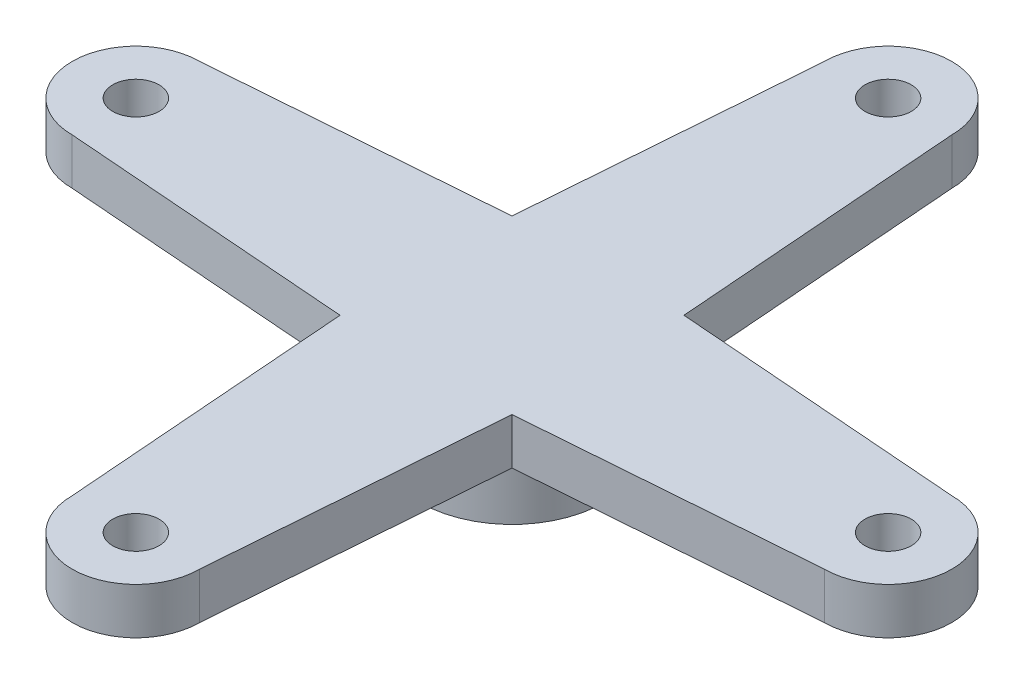
ISO-10303-21;
HEADER;
FILE_DESCRIPTION(('STEP AP214'),'2;1');
FILE_NAME('part.step','',(''),(''),'','','');
FILE_SCHEMA(('AUTOMOTIVE_DESIGN { 1 0 10303 214 1 1 1 1 }'));
ENDSEC;
DATA;
#1=APPLICATION_CONTEXT('core data for automotive mechanical design processes');
#2=APPLICATION_PROTOCOL_DEFINITION('international standard','automotive_design',2000,#1);
#3=PRODUCT_CONTEXT('',#1,'mechanical');
#4=PRODUCT('Part','Part','',(#3));
#5=PRODUCT_RELATED_PRODUCT_CATEGORY('part','',(#4));
#6=PRODUCT_DEFINITION_FORMATION('','',#4);
#7=PRODUCT_DEFINITION_CONTEXT('part definition',#1,'design');
#8=PRODUCT_DEFINITION('design','',#6,#7);
#9=PRODUCT_DEFINITION_SHAPE('','',#8);
#10=(LENGTH_UNIT() NAMED_UNIT(*) SI_UNIT(.MILLI.,.METRE.));
#11=(NAMED_UNIT(*) PLANE_ANGLE_UNIT() SI_UNIT($,.RADIAN.));
#12=(NAMED_UNIT(*) SI_UNIT($,.STERADIAN.) SOLID_ANGLE_UNIT());
#13=UNCERTAINTY_MEASURE_WITH_UNIT(LENGTH_MEASURE(1.E-05),#10,'distance_accuracy_value','');
#14=(GEOMETRIC_REPRESENTATION_CONTEXT(3) GLOBAL_UNCERTAINTY_ASSIGNED_CONTEXT((#13)) GLOBAL_UNIT_ASSIGNED_CONTEXT((#10,
#11,#12)) REPRESENTATION_CONTEXT('',''));
#15=CARTESIAN_POINT('',(0.,0.,0.));
#16=DIRECTION('',(0.,0.,1.));
#17=DIRECTION('',(1.,0.,0.));
#18=AXIS2_PLACEMENT_3D('',#15,#16,#17);
#19=CARTESIAN_POINT('',(3.97647058823529,5.,-0.305882352941177));
#20=DIRECTION('',(-0.997054485501581,0.,0.0766964988847373));
#21=DIRECTION('',(0.0766964988847373,0.,0.997054485501582));
#22=AXIS2_PLACEMENT_3D('',#19,#20,#21);
#23=PLANE('',#22);
#24=DIRECTION('',(-0.0766964988847373,0.,-0.997054485501582));
#25=VECTOR('',#24,1.);
#26=CARTESIAN_POINT('',(3.97647058823529,3.,-0.305882352941177));
#27=LINE('',#26,#25);
#28=CARTESIAN_POINT('',(3.71428571428571,3.,-3.71428571428571));
#29=VERTEX_POINT('',#28);
#30=CARTESIAN_POINT('',(2.7500000000001,3.,-16.2499999999996));
#31=VERTEX_POINT('',#30);
#32=EDGE_CURVE('E189',#29,#31,#27,.T.);
#33=ORIENTED_EDGE('',*,*,#32,.T.);
#34=DIRECTION('',(0.,-1.,0.));
#35=VECTOR('',#34,1.);
#36=CARTESIAN_POINT('',(2.7500000000001,5.,-16.2499999999996));
#37=LINE('',#36,#35);
#38=CARTESIAN_POINT('',(2.7500000000001,5.,-16.2499999999996));
#39=VERTEX_POINT('',#38);
#40=EDGE_CURVE('E12',#39,#31,#37,.T.);
#41=ORIENTED_EDGE('',*,*,#40,.F.);
#42=DIRECTION('',(-0.0766964988847373,0.,-0.997054485501582));
#43=VECTOR('',#42,1.);
#44=CARTESIAN_POINT('',(3.97647058823529,5.,-0.305882352941177));
#45=LINE('',#44,#43);
#46=CARTESIAN_POINT('',(3.71428571428571,5.,-3.71428571428571));
#47=VERTEX_POINT('',#46);
#48=EDGE_CURVE('E247',#47,#39,#45,.T.);
#49=ORIENTED_EDGE('',*,*,#48,.F.);
#50=DIRECTION('',(0.,-1.,0.));
#51=VECTOR('',#50,1.);
#52=CARTESIAN_POINT('',(3.71428571428571,5.,-3.71428571428571));
#53=LINE('',#52,#51);
#54=EDGE_CURVE('E64',#47,#29,#53,.T.);
#55=ORIENTED_EDGE('',*,*,#54,.T.);
#56=EDGE_LOOP('',(#33,#41,#49,#55));
#57=FACE_BOUND('',#56,.T.);
#58=ADVANCED_FACE('F47',(#57),#23,.F.);
#59=CARTESIAN_POINT('',(1.71077077006591E-13,5.,-16.25));
#60=DIRECTION('',(0.,-1.,0.));
#61=DIRECTION('',(0.,0.,-1.));
#62=AXIS2_PLACEMENT_3D('',#59,#60,#61);
#63=CYLINDRICAL_SURFACE('',#62,2.75);
#64=CARTESIAN_POINT('',(1.71077077006591E-13,3.,-16.25));
#65=DIRECTION('',(0.,1.,0.));
#66=DIRECTION('',(0.,0.,1.));
#67=AXIS2_PLACEMENT_3D('',#64,#65,#66);
#68=CIRCLE('',#67,2.75);
#69=CARTESIAN_POINT('',(-2.7499999999999,3.,-16.2500000000004));
#70=VERTEX_POINT('',#69);
#71=EDGE_CURVE('E192',#31,#70,#68,.T.);
#72=ORIENTED_EDGE('',*,*,#71,.T.);
#73=DIRECTION('',(0.,-1.,0.));
#74=VECTOR('',#73,1.);
#75=CARTESIAN_POINT('',(-2.7499999999999,5.,-16.2500000000004));
#76=LINE('',#75,#74);
#77=CARTESIAN_POINT('',(-2.7499999999999,5.,-16.2500000000004));
#78=VERTEX_POINT('',#77);
#79=EDGE_CURVE('E56',#78,#70,#76,.T.);
#80=ORIENTED_EDGE('',*,*,#79,.F.);
#81=CARTESIAN_POINT('',(1.71077077006591E-13,5.,-16.25));
#82=DIRECTION('',(0.,1.,0.));
#83=DIRECTION('',(0.,0.,1.));
#84=AXIS2_PLACEMENT_3D('',#81,#82,#83);
#85=CIRCLE('',#84,2.75);
#86=EDGE_CURVE('E115',#39,#78,#85,.T.);
#87=ORIENTED_EDGE('',*,*,#86,.F.);
#88=ORIENTED_EDGE('',*,*,#40,.T.);
#89=EDGE_LOOP('',(#72,#80,#87,#88));
#90=FACE_BOUND('',#89,.T.);
#91=ADVANCED_FACE('F280',(#90),#63,.T.);
#92=CARTESIAN_POINT('',(-3.97647058823529,5.,-0.305882352941176));
#93=DIRECTION('',(-0.997054485501582,0.,-0.076696498884737));
#94=DIRECTION('',(-0.076696498884737,0.,0.997054485501582));
#95=AXIS2_PLACEMENT_3D('',#92,#93,#94);
#96=PLANE('',#95);
#97=DIRECTION('',(0.076696498884737,0.,-0.997054485501582));
#98=VECTOR('',#97,1.);
#99=CARTESIAN_POINT('',(-3.97647058823529,3.,-0.305882352941176));
#100=LINE('',#99,#98);
#101=CARTESIAN_POINT('',(-3.71428571428572,3.,-3.71428571428571));
#102=VERTEX_POINT('',#101);
#103=EDGE_CURVE('E196',#102,#70,#100,.T.);
#104=ORIENTED_EDGE('',*,*,#103,.F.);
#105=DIRECTION('',(0.,-1.,0.));
#106=VECTOR('',#105,1.);
#107=CARTESIAN_POINT('',(-3.71428571428572,5.,-3.71428571428571));
#108=LINE('',#107,#106);
#109=CARTESIAN_POINT('',(-3.71428571428572,5.,-3.71428571428571));
#110=VERTEX_POINT('',#109);
#111=EDGE_CURVE('E271',#110,#102,#108,.T.);
#112=ORIENTED_EDGE('',*,*,#111,.F.);
#113=DIRECTION('',(0.076696498884737,0.,-0.997054485501582));
#114=VECTOR('',#113,1.);
#115=CARTESIAN_POINT('',(-3.97647058823529,5.,-0.305882352941176));
#116=LINE('',#115,#114);
#117=EDGE_CURVE('E279',#110,#78,#116,.T.);
#118=ORIENTED_EDGE('',*,*,#117,.T.);
#119=ORIENTED_EDGE('',*,*,#79,.T.);
#120=EDGE_LOOP('',(#104,#112,#118,#119));
#121=FACE_BOUND('',#120,.T.);
#122=ADVANCED_FACE('F277',(#121),#96,.T.);
#123=CARTESIAN_POINT('',(-0.305882352941177,5.,-3.97647058823529));
#124=DIRECTION('',(0.0766964988847372,0.,0.997054485501581));
#125=DIRECTION('',(0.997054485501582,0.,-0.0766964988847372));
#126=AXIS2_PLACEMENT_3D('',#123,#124,#125);
#127=PLANE('',#126);
#128=DIRECTION('',(-0.997054485501582,0.,0.0766964988847372));
#129=VECTOR('',#128,1.);
#130=CARTESIAN_POINT('',(-0.305882352941177,3.,-3.97647058823529));
#131=LINE('',#130,#129);
#132=CARTESIAN_POINT('',(-16.2500000000004,3.,-2.75000000000004));
#133=VERTEX_POINT('',#132);
#134=EDGE_CURVE('E200',#102,#133,#131,.T.);
#135=ORIENTED_EDGE('',*,*,#134,.T.);
#136=DIRECTION('',(0.,-1.,0.));
#137=VECTOR('',#136,1.);
#138=CARTESIAN_POINT('',(-16.2500000000004,5.,-2.75000000000004));
#139=LINE('',#138,#137);
#140=CARTESIAN_POINT('',(-16.2500000000004,5.,-2.75000000000004));
#141=VERTEX_POINT('',#140);
#142=EDGE_CURVE('E267',#141,#133,#139,.T.);
#143=ORIENTED_EDGE('',*,*,#142,.F.);
#144=DIRECTION('',(-0.997054485501582,0.,0.0766964988847372));
#145=VECTOR('',#144,1.);
#146=CARTESIAN_POINT('',(-0.305882352941177,5.,-3.97647058823529));
#147=LINE('',#146,#145);
#148=EDGE_CURVE('E300',#110,#141,#147,.T.);
#149=ORIENTED_EDGE('',*,*,#148,.F.);
#150=ORIENTED_EDGE('',*,*,#111,.T.);
#151=EDGE_LOOP('',(#135,#143,#149,#150));
#152=FACE_BOUND('',#151,.T.);
#153=ADVANCED_FACE('F289',(#152),#127,.F.);
#154=CARTESIAN_POINT('',(-16.25,5.,-1.13473143512402E-13));
#155=DIRECTION('',(0.,-1.,0.));
#156=DIRECTION('',(0.,0.,-1.));
#157=AXIS2_PLACEMENT_3D('',#154,#155,#156);
#158=CYLINDRICAL_SURFACE('',#157,2.75);
#159=CARTESIAN_POINT('',(-16.25,3.,-1.13473143512402E-13));
#160=DIRECTION('',(0.,1.,0.));
#161=DIRECTION('',(0.,0.,1.));
#162=AXIS2_PLACEMENT_3D('',#159,#160,#161);
#163=CIRCLE('',#162,2.75);
#164=CARTESIAN_POINT('',(-16.25,3.,2.74999999999994));
#165=VERTEX_POINT('',#164);
#166=EDGE_CURVE('E203',#133,#165,#163,.T.);
#167=ORIENTED_EDGE('',*,*,#166,.T.);
#168=DIRECTION('',(0.,-1.,0.));
#169=VECTOR('',#168,1.);
#170=CARTESIAN_POINT('',(-16.25,5.,2.74999999999994));
#171=LINE('',#170,#169);
#172=CARTESIAN_POINT('',(-16.25,5.,2.74999999999994));
#173=VERTEX_POINT('',#172);
#174=EDGE_CURVE('E264',#173,#165,#171,.T.);
#175=ORIENTED_EDGE('',*,*,#174,.F.);
#176=CARTESIAN_POINT('',(-16.25,5.,-1.13473143512402E-13));
#177=DIRECTION('',(0.,1.,0.));
#178=DIRECTION('',(0.,0.,1.));
#179=AXIS2_PLACEMENT_3D('',#176,#177,#178);
#180=CIRCLE('',#179,2.75);
#181=EDGE_CURVE('E295',#141,#173,#180,.T.);
#182=ORIENTED_EDGE('',*,*,#181,.F.);
#183=ORIENTED_EDGE('',*,*,#142,.T.);
#184=EDGE_LOOP('',(#167,#175,#182,#183));
#185=FACE_BOUND('',#184,.T.);
#186=ADVANCED_FACE('F293',(#185),#158,.T.);
#187=CARTESIAN_POINT('',(-0.305882352941177,5.,3.97647058823529));
#188=DIRECTION('',(-0.0766964988847371,0.,0.997054485501582));
#189=DIRECTION('',(0.997054485501582,0.,0.0766964988847371));
#190=AXIS2_PLACEMENT_3D('',#187,#188,#189);
#191=PLANE('',#190);
#192=DIRECTION('',(-0.997054485501582,0.,-0.0766964988847371));
#193=VECTOR('',#192,1.);
#194=CARTESIAN_POINT('',(-0.305882352941177,3.,3.97647058823529));
#195=LINE('',#194,#193);
#196=CARTESIAN_POINT('',(-3.71428571428573,3.,3.71428571428571));
#197=VERTEX_POINT('',#196);
#198=EDGE_CURVE('E207',#197,#165,#195,.T.);
#199=ORIENTED_EDGE('',*,*,#198,.F.);
#200=DIRECTION('',(0.,-1.,0.));
#201=VECTOR('',#200,1.);
#202=CARTESIAN_POINT('',(-3.71428571428573,5.,3.71428571428571));
#203=LINE('',#202,#201);
#204=CARTESIAN_POINT('',(-3.71428571428573,5.,3.71428571428571));
#205=VERTEX_POINT('',#204);
#206=EDGE_CURVE('E261',#205,#197,#203,.T.);
#207=ORIENTED_EDGE('',*,*,#206,.F.);
#208=DIRECTION('',(-0.997054485501582,0.,-0.0766964988847371));
#209=VECTOR('',#208,1.);
#210=CARTESIAN_POINT('',(-0.305882352941177,5.,3.97647058823529));
#211=LINE('',#210,#209);
#212=EDGE_CURVE('E299',#205,#173,#211,.T.);
#213=ORIENTED_EDGE('',*,*,#212,.T.);
#214=ORIENTED_EDGE('',*,*,#174,.T.);
#215=EDGE_LOOP('',(#199,#207,#213,#214));
#216=FACE_BOUND('',#215,.T.);
#217=ADVANCED_FACE('F352',(#216),#191,.T.);
#218=CARTESIAN_POINT('',(-3.97647058823531,5.,0.305882352941183));
#219=DIRECTION('',(0.997054485501581,0.,-0.0766964988847385));
#220=DIRECTION('',(-0.0766964988847385,0.,-0.997054485501581));
#221=AXIS2_PLACEMENT_3D('',#218,#219,#220);
#222=PLANE('',#221);
#223=DIRECTION('',(0.0766964988847385,0.,0.997054485501581));
#224=VECTOR('',#223,1.);
#225=CARTESIAN_POINT('',(-3.97647058823531,3.,0.305882352941183));
#226=LINE('',#225,#224);
#227=CARTESIAN_POINT('',(-2.75000000000001,3.,16.2500000000004));
#228=VERTEX_POINT('',#227);
#229=EDGE_CURVE('E211',#197,#228,#226,.T.);
#230=ORIENTED_EDGE('',*,*,#229,.T.);
#231=DIRECTION('',(0.,-1.,0.));
#232=VECTOR('',#231,1.);
#233=CARTESIAN_POINT('',(-2.75000000000001,5.,16.2500000000004));
#234=LINE('',#233,#232);
#235=CARTESIAN_POINT('',(-2.75000000000001,5.,16.2500000000004));
#236=VERTEX_POINT('',#235);
#237=EDGE_CURVE('E257',#236,#228,#234,.T.);
#238=ORIENTED_EDGE('',*,*,#237,.F.);
#239=DIRECTION('',(0.0766964988847385,0.,0.997054485501581));
#240=VECTOR('',#239,1.);
#241=CARTESIAN_POINT('',(-3.97647058823531,5.,0.305882352941183));
#242=LINE('',#241,#240);
#243=EDGE_CURVE('E304',#205,#236,#242,.T.);
#244=ORIENTED_EDGE('',*,*,#243,.F.);
#245=ORIENTED_EDGE('',*,*,#206,.T.);
#246=EDGE_LOOP('',(#230,#238,#244,#245));
#247=FACE_BOUND('',#246,.T.);
#248=ADVANCED_FACE('F355',(#247),#222,.F.);
#249=CARTESIAN_POINT('',(0.,5.,16.25));
#250=DIRECTION('',(0.,-1.,0.));
#251=DIRECTION('',(0.,0.,-1.));
#252=AXIS2_PLACEMENT_3D('',#249,#250,#251);
#253=CYLINDRICAL_SURFACE('',#252,2.75);
#254=CARTESIAN_POINT('',(0.,3.,16.25));
#255=DIRECTION('',(0.,1.,0.));
#256=DIRECTION('',(0.,0.,1.));
#257=AXIS2_PLACEMENT_3D('',#254,#255,#256);
#258=CIRCLE('',#257,2.75);
#259=CARTESIAN_POINT('',(2.74999999999946,3.,16.2500000000132));
#260=VERTEX_POINT('',#259);
#261=EDGE_CURVE('E214',#228,#260,#258,.T.);
#262=ORIENTED_EDGE('',*,*,#261,.T.);
#263=DIRECTION('',(0.,-1.,0.));
#264=VECTOR('',#263,1.);
#265=CARTESIAN_POINT('',(2.74999999999946,5.,16.2500000000132));
#266=LINE('',#265,#264);
#267=CARTESIAN_POINT('',(2.74999999999946,5.,16.2500000000132));
#268=VERTEX_POINT('',#267);
#269=EDGE_CURVE('E254',#268,#260,#266,.T.);
#270=ORIENTED_EDGE('',*,*,#269,.F.);
#271=CARTESIAN_POINT('',(0.,5.,16.25));
#272=DIRECTION('',(0.,1.,0.));
#273=DIRECTION('',(0.,0.,1.));
#274=AXIS2_PLACEMENT_3D('',#271,#272,#273);
#275=CIRCLE('',#274,2.75);
#276=EDGE_CURVE('E311',#236,#268,#275,.T.);
#277=ORIENTED_EDGE('',*,*,#276,.F.);
#278=ORIENTED_EDGE('',*,*,#237,.T.);
#279=EDGE_LOOP('',(#262,#270,#277,#278));
#280=FACE_BOUND('',#279,.T.);
#281=ADVANCED_FACE('F359',(#280),#253,.T.);
#282=CARTESIAN_POINT('',(3.97647058823529,5.,0.305882352941175));
#283=DIRECTION('',(0.997054485501582,0.,0.0766964988847368));
#284=DIRECTION('',(0.0766964988847368,0.,-0.997054485501582));
#285=AXIS2_PLACEMENT_3D('',#282,#283,#284);
#286=PLANE('',#285);
#287=DIRECTION('',(-0.0766964988847368,0.,0.997054485501582));
#288=VECTOR('',#287,1.);
#289=CARTESIAN_POINT('',(3.97647058823529,3.,0.305882352941175));
#290=LINE('',#289,#288);
#291=CARTESIAN_POINT('',(3.71428571428572,3.,3.71428571428571));
#292=VERTEX_POINT('',#291);
#293=EDGE_CURVE('E218',#292,#260,#290,.T.);
#294=ORIENTED_EDGE('',*,*,#293,.F.);
#295=DIRECTION('',(0.,-1.,0.));
#296=VECTOR('',#295,1.);
#297=CARTESIAN_POINT('',(3.71428571428572,5.,3.71428571428571));
#298=LINE('',#297,#296);
#299=CARTESIAN_POINT('',(3.71428571428572,5.,3.71428571428571));
#300=VERTEX_POINT('',#299);
#301=EDGE_CURVE('E163',#300,#292,#298,.T.);
#302=ORIENTED_EDGE('',*,*,#301,.F.);
#303=DIRECTION('',(-0.0766964988847368,0.,0.997054485501582));
#304=VECTOR('',#303,1.);
#305=CARTESIAN_POINT('',(3.97647058823529,5.,0.305882352941175));
#306=LINE('',#305,#304);
#307=EDGE_CURVE('E151',#300,#268,#306,.T.);
#308=ORIENTED_EDGE('',*,*,#307,.T.);
#309=ORIENTED_EDGE('',*,*,#269,.T.);
#310=EDGE_LOOP('',(#294,#302,#308,#309));
#311=FACE_BOUND('',#310,.T.);
#312=ADVANCED_FACE('F316',(#311),#286,.T.);
#313=CARTESIAN_POINT('',(0.305882352941177,5.,3.97647058823529));
#314=DIRECTION('',(-0.0766964988847372,0.,-0.997054485501581));
#315=DIRECTION('',(-0.997054485501582,0.,0.0766964988847372));
#316=AXIS2_PLACEMENT_3D('',#313,#314,#315);
#317=PLANE('',#316);
#318=DIRECTION('',(0.997054485501582,0.,-0.0766964988847372));
#319=VECTOR('',#318,1.);
#320=CARTESIAN_POINT('',(0.305882352941177,3.,3.97647058823529));
#321=LINE('',#320,#319);
#322=CARTESIAN_POINT('',(16.25,3.,2.75));
#323=VERTEX_POINT('',#322);
#324=EDGE_CURVE('E159',#292,#323,#321,.T.);
#325=ORIENTED_EDGE('',*,*,#324,.T.);
#326=DIRECTION('',(0.,-1.,0.));
#327=VECTOR('',#326,1.);
#328=CARTESIAN_POINT('',(16.25,5.,2.75));
#329=LINE('',#328,#327);
#330=CARTESIAN_POINT('',(16.25,5.,2.75));
#331=VERTEX_POINT('',#330);
#332=EDGE_CURVE('E156',#331,#323,#329,.T.);
#333=ORIENTED_EDGE('',*,*,#332,.F.);
#334=DIRECTION('',(0.997054485501582,0.,-0.0766964988847372));
#335=VECTOR('',#334,1.);
#336=CARTESIAN_POINT('',(0.305882352941177,5.,3.97647058823529));
#337=LINE('',#336,#335);
#338=EDGE_CURVE('E143',#300,#331,#337,.T.);
#339=ORIENTED_EDGE('',*,*,#338,.F.);
#340=ORIENTED_EDGE('',*,*,#301,.T.);
#341=EDGE_LOOP('',(#325,#333,#339,#340));
#342=FACE_BOUND('',#341,.T.);
#343=ADVANCED_FACE('F157',(#342),#317,.F.);
#344=CARTESIAN_POINT('',(16.25,5.,0.));
#345=DIRECTION('',(0.,-1.,0.));
#346=DIRECTION('',(0.,0.,-1.));
#347=AXIS2_PLACEMENT_3D('',#344,#345,#346);
#348=CYLINDRICAL_SURFACE('',#347,2.75);
#349=CARTESIAN_POINT('',(16.25,3.,0.));
#350=DIRECTION('',(0.,1.,0.));
#351=DIRECTION('',(0.,0.,1.));
#352=AXIS2_PLACEMENT_3D('',#349,#350,#351);
#353=CIRCLE('',#352,2.75);
#354=CARTESIAN_POINT('',(16.25,3.,-2.75));
#355=VERTEX_POINT('',#354);
#356=EDGE_CURVE('E224',#323,#355,#353,.T.);
#357=ORIENTED_EDGE('',*,*,#356,.T.);
#358=DIRECTION('',(0.,-1.,0.));
#359=VECTOR('',#358,1.);
#360=CARTESIAN_POINT('',(16.25,5.,-2.75));
#361=LINE('',#360,#359);
#362=CARTESIAN_POINT('',(16.25,5.,-2.75));
#363=VERTEX_POINT('',#362);
#364=EDGE_CURVE('E103',#363,#355,#361,.T.);
#365=ORIENTED_EDGE('',*,*,#364,.F.);
#366=CARTESIAN_POINT('',(16.25,5.,0.));
#367=DIRECTION('',(0.,1.,0.));
#368=DIRECTION('',(0.,0.,1.));
#369=AXIS2_PLACEMENT_3D('',#366,#367,#368);
#370=CIRCLE('',#369,2.75);
#371=EDGE_CURVE('E149',#331,#363,#370,.T.);
#372=ORIENTED_EDGE('',*,*,#371,.F.);
#373=ORIENTED_EDGE('',*,*,#332,.T.);
#374=EDGE_LOOP('',(#357,#365,#372,#373));
#375=FACE_BOUND('',#374,.T.);
#376=ADVANCED_FACE('F165',(#375),#348,.T.);
#377=CARTESIAN_POINT('',(-16.25,5.,-1.13473143512402E-13));
#378=DIRECTION('',(0.,-1.,0.));
#379=DIRECTION('',(0.,0.,-1.));
#380=AXIS2_PLACEMENT_3D('',#377,#378,#379);
#381=CYLINDRICAL_SURFACE('',#380,1.);
#382=CARTESIAN_POINT('',(-16.25,5.,-1.13473143512402E-13));
#383=DIRECTION('',(0.,1.,0.));
#384=DIRECTION('',(0.,0.,1.));
#385=AXIS2_PLACEMENT_3D('',#382,#383,#384);
#386=CIRCLE('',#385,1.);
#387=CARTESIAN_POINT('',(-16.25,5.,0.999999999999889));
#388=VERTEX_POINT('',#387);
#389=EDGE_CURVE('E181',#388,#388,#386,.T.);
#390=ORIENTED_EDGE('',*,*,#389,.T.);
#391=EDGE_LOOP('',(#390));
#392=FACE_BOUND('',#391,.T.);
#393=CARTESIAN_POINT('',(-16.25,3.,-1.13473143512402E-13));
#394=DIRECTION('',(0.,1.,0.));
#395=DIRECTION('',(0.,0.,1.));
#396=AXIS2_PLACEMENT_3D('',#393,#394,#395);
#397=CIRCLE('',#396,1.);
#398=CARTESIAN_POINT('',(-16.25,3.,0.999999999999889));
#399=VERTEX_POINT('',#398);
#400=EDGE_CURVE('E239',#399,#399,#397,.T.);
#401=ORIENTED_EDGE('',*,*,#400,.F.);
#402=EDGE_LOOP('',(#401));
#403=FACE_BOUND('',#402,.T.);
#404=ADVANCED_FACE('F368',(#392,#403),#381,.F.);
#405=CARTESIAN_POINT('',(0.,5.,16.25));
#406=DIRECTION('',(0.,-1.,0.));
#407=DIRECTION('',(0.,0.,-1.));
#408=AXIS2_PLACEMENT_3D('',#405,#406,#407);
#409=CYLINDRICAL_SURFACE('',#408,1.);
#410=CARTESIAN_POINT('',(0.,5.,16.25));
#411=DIRECTION('',(0.,1.,0.));
#412=DIRECTION('',(0.,0.,1.));
#413=AXIS2_PLACEMENT_3D('',#410,#411,#412);
#414=CIRCLE('',#413,1.);
#415=CARTESIAN_POINT('',(0.,5.,17.25));
#416=VERTEX_POINT('',#415);
#417=EDGE_CURVE('E177',#416,#416,#414,.T.);
#418=ORIENTED_EDGE('',*,*,#417,.T.);
#419=EDGE_LOOP('',(#418));
#420=FACE_BOUND('',#419,.T.);
#421=CARTESIAN_POINT('',(0.,3.,16.25));
#422=DIRECTION('',(0.,1.,0.));
#423=DIRECTION('',(0.,0.,1.));
#424=AXIS2_PLACEMENT_3D('',#421,#422,#423);
#425=CIRCLE('',#424,1.);
#426=CARTESIAN_POINT('',(0.,3.,17.25));
#427=VERTEX_POINT('',#426);
#428=EDGE_CURVE('E235',#427,#427,#425,.T.);
#429=ORIENTED_EDGE('',*,*,#428,.F.);
#430=EDGE_LOOP('',(#429));
#431=FACE_BOUND('',#430,.T.);
#432=ADVANCED_FACE('F330',(#420,#431),#409,.F.);
#433=CARTESIAN_POINT('',(16.25,5.,0.));
#434=DIRECTION('',(0.,-1.,0.));
#435=DIRECTION('',(0.,0.,-1.));
#436=AXIS2_PLACEMENT_3D('',#433,#434,#435);
#437=CYLINDRICAL_SURFACE('',#436,1.);
#438=CARTESIAN_POINT('',(16.25,5.,0.));
#439=DIRECTION('',(0.,1.,0.));
#440=DIRECTION('',(0.,0.,1.));
#441=AXIS2_PLACEMENT_3D('',#438,#439,#440);
#442=CIRCLE('',#441,1.);
#443=CARTESIAN_POINT('',(16.25,5.,1.));
#444=VERTEX_POINT('',#443);
#445=EDGE_CURVE('E170',#444,#444,#442,.T.);
#446=ORIENTED_EDGE('',*,*,#445,.T.);
#447=EDGE_LOOP('',(#446));
#448=FACE_BOUND('',#447,.T.);
#449=CARTESIAN_POINT('',(16.25,3.,0.));
#450=DIRECTION('',(0.,1.,0.));
#451=DIRECTION('',(0.,0.,1.));
#452=AXIS2_PLACEMENT_3D('',#449,#450,#451);
#453=CIRCLE('',#452,1.);
#454=CARTESIAN_POINT('',(16.25,3.,1.));
#455=VERTEX_POINT('',#454);
#456=EDGE_CURVE('E231',#455,#455,#453,.T.);
#457=ORIENTED_EDGE('',*,*,#456,.F.);
#458=EDGE_LOOP('',(#457));
#459=FACE_BOUND('',#458,.T.);
#460=ADVANCED_FACE('F322',(#448,#459),#437,.F.);
#461=CARTESIAN_POINT('',(0.305882352941177,5.,-3.97647058823529));
#462=DIRECTION('',(0.0766964988847372,0.,-0.997054485501581));
#463=DIRECTION('',(-0.997054485501582,0.,-0.0766964988847372));
#464=AXIS2_PLACEMENT_3D('',#461,#462,#463);
#465=PLANE('',#464);
#466=DIRECTION('',(0.997054485501582,0.,0.0766964988847372));
#467=VECTOR('',#466,1.);
#468=CARTESIAN_POINT('',(0.305882352941177,3.,-3.97647058823529));
#469=LINE('',#468,#467);
#470=EDGE_CURVE('E227',#29,#355,#469,.T.);
#471=ORIENTED_EDGE('',*,*,#470,.F.);
#472=ORIENTED_EDGE('',*,*,#54,.F.);
#473=DIRECTION('',(0.997054485501582,0.,0.0766964988847372));
#474=VECTOR('',#473,1.);
#475=CARTESIAN_POINT('',(0.305882352941177,5.,-3.97647058823529));
#476=LINE('',#475,#474);
#477=EDGE_CURVE('E167',#47,#363,#476,.T.);
#478=ORIENTED_EDGE('',*,*,#477,.T.);
#479=ORIENTED_EDGE('',*,*,#364,.T.);
#480=EDGE_LOOP('',(#471,#472,#478,#479));
#481=FACE_BOUND('',#480,.T.);
#482=ADVANCED_FACE('F319',(#481),#465,.T.);
#483=CARTESIAN_POINT('',(1.71077077006591E-13,5.,-16.25));
#484=DIRECTION('',(0.,-1.,0.));
#485=DIRECTION('',(0.,0.,-1.));
#486=AXIS2_PLACEMENT_3D('',#483,#484,#485);
#487=CYLINDRICAL_SURFACE('',#486,1.);
#488=CARTESIAN_POINT('',(1.71077077006591E-13,5.,-16.25));
#489=DIRECTION('',(0.,1.,0.));
#490=DIRECTION('',(0.,0.,1.));
#491=AXIS2_PLACEMENT_3D('',#488,#489,#490);
#492=CIRCLE('',#491,1.);
#493=CARTESIAN_POINT('',(1.71077077006591E-13,5.,-15.25));
#494=VERTEX_POINT('',#493);
#495=EDGE_CURVE('E185',#494,#494,#492,.T.);
#496=ORIENTED_EDGE('',*,*,#495,.T.);
#497=EDGE_LOOP('',(#496));
#498=FACE_BOUND('',#497,.T.);
#499=CARTESIAN_POINT('',(1.71077077006591E-13,3.,-16.25));
#500=DIRECTION('',(0.,1.,0.));
#501=DIRECTION('',(0.,0.,1.));
#502=AXIS2_PLACEMENT_3D('',#499,#500,#501);
#503=CIRCLE('',#502,1.);
#504=CARTESIAN_POINT('',(1.71077077006591E-13,3.,-15.25));
#505=VERTEX_POINT('',#504);
#506=EDGE_CURVE('E243',#505,#505,#503,.T.);
#507=ORIENTED_EDGE('',*,*,#506,.F.);
#508=EDGE_LOOP('',(#507));
#509=FACE_BOUND('',#508,.T.);
#510=ADVANCED_FACE('F321',(#498,#509),#487,.F.);
#511=CARTESIAN_POINT('',(0.,5.,0.));
#512=DIRECTION('',(0.,1.,0.));
#513=DIRECTION('',(0.,0.,1.));
#514=AXIS2_PLACEMENT_3D('',#511,#512,#513);
#515=PLANE('',#514);
#516=ORIENTED_EDGE('',*,*,#48,.T.);
#517=ORIENTED_EDGE('',*,*,#86,.T.);
#518=ORIENTED_EDGE('',*,*,#117,.F.);
#519=ORIENTED_EDGE('',*,*,#148,.T.);
#520=ORIENTED_EDGE('',*,*,#181,.T.);
#521=ORIENTED_EDGE('',*,*,#212,.F.);
#522=ORIENTED_EDGE('',*,*,#243,.T.);
#523=ORIENTED_EDGE('',*,*,#276,.T.);
#524=ORIENTED_EDGE('',*,*,#307,.F.);
#525=ORIENTED_EDGE('',*,*,#338,.T.);
#526=ORIENTED_EDGE('',*,*,#371,.T.);
#527=ORIENTED_EDGE('',*,*,#477,.F.);
#528=EDGE_LOOP('',(#516,#517,#518,#519,#520,#521,#522,#523,#524,#525,#526,#527));
#529=FACE_BOUND('',#528,.T.);
#530=ORIENTED_EDGE('',*,*,#445,.F.);
#531=EDGE_LOOP('',(#530));
#532=FACE_BOUND('',#531,.T.);
#533=ORIENTED_EDGE('',*,*,#417,.F.);
#534=EDGE_LOOP('',(#533));
#535=FACE_BOUND('',#534,.T.);
#536=ORIENTED_EDGE('',*,*,#389,.F.);
#537=EDGE_LOOP('',(#536));
#538=FACE_BOUND('',#537,.T.);
#539=ORIENTED_EDGE('',*,*,#495,.F.);
#540=EDGE_LOOP('',(#539));
#541=FACE_BOUND('',#540,.T.);
#542=ADVANCED_FACE('F145',(#529,#532,#535,#538,#541),#515,.T.);
#543=CARTESIAN_POINT('',(0.,3.,0.));
#544=DIRECTION('',(0.,1.,0.));
#545=DIRECTION('',(0.,0.,1.));
#546=AXIS2_PLACEMENT_3D('',#543,#544,#545);
#547=PLANE('',#546);
#548=ORIENTED_EDGE('',*,*,#32,.F.);
#549=ORIENTED_EDGE('',*,*,#470,.T.);
#550=ORIENTED_EDGE('',*,*,#356,.F.);
#551=ORIENTED_EDGE('',*,*,#324,.F.);
#552=ORIENTED_EDGE('',*,*,#293,.T.);
#553=ORIENTED_EDGE('',*,*,#261,.F.);
#554=ORIENTED_EDGE('',*,*,#229,.F.);
#555=ORIENTED_EDGE('',*,*,#198,.T.);
#556=ORIENTED_EDGE('',*,*,#166,.F.);
#557=ORIENTED_EDGE('',*,*,#134,.F.);
#558=ORIENTED_EDGE('',*,*,#103,.T.);
#559=ORIENTED_EDGE('',*,*,#71,.F.);
#560=EDGE_LOOP('',(#548,#549,#550,#551,#552,#553,#554,#555,#556,#557,#558,#559));
#561=FACE_BOUND('',#560,.T.);
#562=ORIENTED_EDGE('',*,*,#456,.T.);
#563=EDGE_LOOP('',(#562));
#564=FACE_BOUND('',#563,.T.);
#565=ORIENTED_EDGE('',*,*,#428,.T.);
#566=EDGE_LOOP('',(#565));
#567=FACE_BOUND('',#566,.T.);
#568=ORIENTED_EDGE('',*,*,#400,.T.);
#569=EDGE_LOOP('',(#568));
#570=FACE_BOUND('',#569,.T.);
#571=ORIENTED_EDGE('',*,*,#506,.T.);
#572=EDGE_LOOP('',(#571));
#573=FACE_BOUND('',#572,.T.);
#574=ADVANCED_FACE('F284',(#561,#564,#567,#570,#573),#547,.F.);
#575=CLOSED_SHELL('',(#58,#91,#122,#153,#186,#217,#248,#281,#312,#343,#376,#404,#432,#460,#482,
#510,#542,#574));
#576=MANIFOLD_SOLID_BREP('B2',#575);
#577=CARTESIAN_POINT('',(0.,3.,0.));
#578=DIRECTION('',(0.,-1.,0.));
#579=DIRECTION('',(0.,0.,-1.));
#580=AXIS2_PLACEMENT_3D('',#577,#578,#579);
#581=CYLINDRICAL_SURFACE('',#580,4.);
#582=CARTESIAN_POINT('',(0.,3.,0.));
#583=DIRECTION('',(0.,1.,0.));
#584=DIRECTION('',(0.,0.,1.));
#585=AXIS2_PLACEMENT_3D('',#582,#583,#584);
#586=CIRCLE('',#585,4.);
#587=CARTESIAN_POINT('',(0.,3.,4.));
#588=VERTEX_POINT('',#587);
#589=EDGE_CURVE('E46',#588,#588,#586,.T.);
#590=ORIENTED_EDGE('',*,*,#589,.F.);
#591=EDGE_LOOP('',(#590));
#592=FACE_BOUND('',#591,.T.);
#593=CARTESIAN_POINT('',(0.,0.,0.));
#594=DIRECTION('',(0.,1.,0.));
#595=DIRECTION('',(0.,0.,1.));
#596=AXIS2_PLACEMENT_3D('',#593,#594,#595);
#597=CIRCLE('',#596,4.);
#598=CARTESIAN_POINT('',(0.,0.,4.));
#599=VERTEX_POINT('',#598);
#600=EDGE_CURVE('E582',#599,#599,#597,.T.);
#601=ORIENTED_EDGE('',*,*,#600,.T.);
#602=EDGE_LOOP('',(#601));
#603=FACE_BOUND('',#602,.T.);
#604=ADVANCED_FACE('F579',(#592,#603),#581,.T.);
#605=CARTESIAN_POINT('',(0.,3.,0.));
#606=DIRECTION('',(0.,1.,0.));
#607=DIRECTION('',(0.,0.,1.));
#608=AXIS2_PLACEMENT_3D('',#605,#606,#607);
#609=PLANE('',#608);
#610=ORIENTED_EDGE('',*,*,#589,.T.);
#611=EDGE_LOOP('',(#610));
#612=FACE_BOUND('',#611,.T.);
#613=ADVANCED_FACE('F594',(#612),#609,.T.);
#614=CARTESIAN_POINT('',(0.,0.,0.));
#615=DIRECTION('',(0.,1.,0.));
#616=DIRECTION('',(0.,0.,1.));
#617=AXIS2_PLACEMENT_3D('',#614,#615,#616);
#618=PLANE('',#617);
#619=ORIENTED_EDGE('',*,*,#600,.F.);
#620=EDGE_LOOP('',(#619));
#621=FACE_BOUND('',#620,.T.);
#622=ADVANCED_FACE('F592',(#621),#618,.F.);
#623=CLOSED_SHELL('',(#604,#613,#622));
#624=MANIFOLD_SOLID_BREP('B6',#623);
#625=ADVANCED_BREP_SHAPE_REPRESENTATION('',(#18,#576,#624),#14);
#626=SHAPE_DEFINITION_REPRESENTATION(#9,#625);
ENDSEC;
END-ISO-10303-21;
